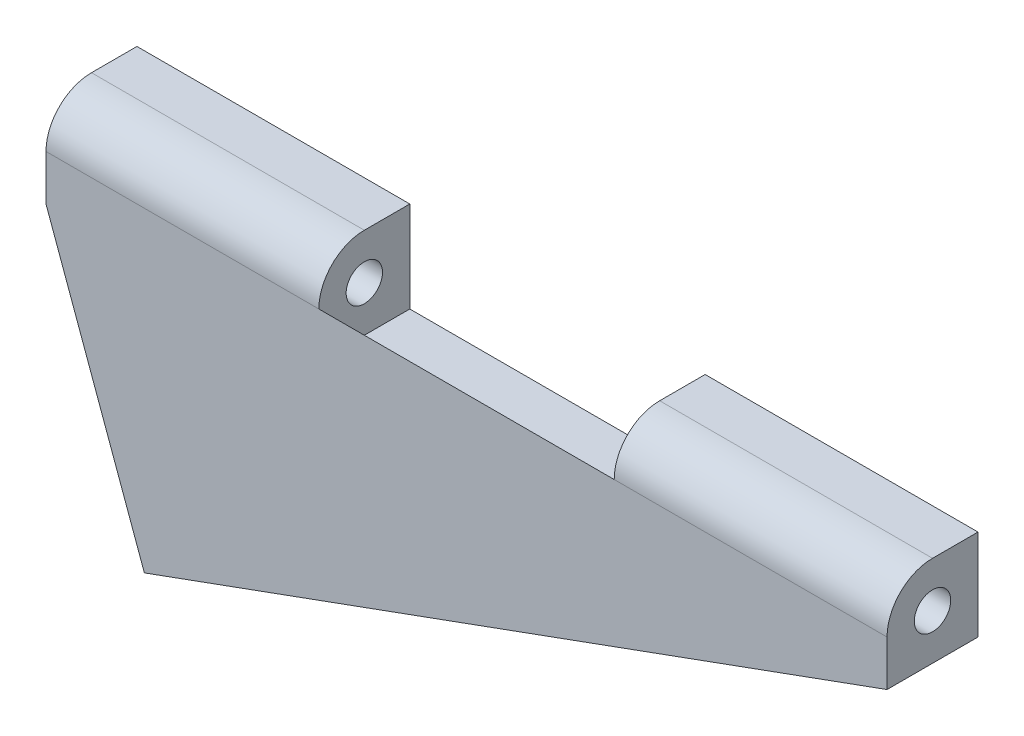
ISO-10303-21;
HEADER;
FILE_DESCRIPTION(('STEP AP214'),'2;1');
FILE_NAME('part.step','',(''),(''),'','','');
FILE_SCHEMA(('AUTOMOTIVE_DESIGN { 1 0 10303 214 1 1 1 1 }'));
ENDSEC;
DATA;
#1=APPLICATION_CONTEXT('core data for automotive mechanical design processes');
#2=APPLICATION_PROTOCOL_DEFINITION('international standard','automotive_design',2000,#1);
#3=PRODUCT_CONTEXT('',#1,'mechanical');
#4=PRODUCT('Part','Part','',(#3));
#5=PRODUCT_RELATED_PRODUCT_CATEGORY('part','',(#4));
#6=PRODUCT_DEFINITION_FORMATION('','',#4);
#7=PRODUCT_DEFINITION_CONTEXT('part definition',#1,'design');
#8=PRODUCT_DEFINITION('design','',#6,#7);
#9=PRODUCT_DEFINITION_SHAPE('','',#8);
#10=(LENGTH_UNIT() NAMED_UNIT(*) SI_UNIT(.MILLI.,.METRE.));
#11=(NAMED_UNIT(*) PLANE_ANGLE_UNIT() SI_UNIT($,.RADIAN.));
#12=(NAMED_UNIT(*) SI_UNIT($,.STERADIAN.) SOLID_ANGLE_UNIT());
#13=UNCERTAINTY_MEASURE_WITH_UNIT(LENGTH_MEASURE(1.E-05),#10,'distance_accuracy_value','');
#14=(GEOMETRIC_REPRESENTATION_CONTEXT(3) GLOBAL_UNCERTAINTY_ASSIGNED_CONTEXT((#13)) GLOBAL_UNIT_ASSIGNED_CONTEXT((#10,
#11,#12)) REPRESENTATION_CONTEXT('',''));
#15=CARTESIAN_POINT('',(0.,0.,0.));
#16=DIRECTION('',(0.,0.,1.));
#17=DIRECTION('',(1.,0.,0.));
#18=AXIS2_PLACEMENT_3D('',#15,#16,#17);
#19=CARTESIAN_POINT('',(0.,0.,0.));
#20=DIRECTION('',(0.,0.,1.));
#21=DIRECTION('',(1.,0.,0.));
#22=AXIS2_PLACEMENT_3D('',#19,#20,#21);
#23=PLANE('',#22);
#24=DIRECTION('',(0.,-1.,0.));
#25=VECTOR('',#24,1.);
#26=CARTESIAN_POINT('',(-39.6704168051158,0.,0.));
#27=LINE('',#26,#25);
#28=CARTESIAN_POINT('',(-39.6704168051158,6.35,0.));
#29=VERTEX_POINT('',#28);
#30=CARTESIAN_POINT('',(-39.6704168051158,0.,0.));
#31=VERTEX_POINT('',#30);
#32=EDGE_CURVE('E152',#29,#31,#27,.T.);
#33=ORIENTED_EDGE('',*,*,#32,.T.);
#34=DIRECTION('',(1.,0.,0.));
#35=VECTOR('',#34,1.);
#36=CARTESIAN_POINT('',(-67.700672926185,0.,0.));
#37=LINE('',#36,#35);
#38=CARTESIAN_POINT('',(-19.05,0.,0.));
#39=VERTEX_POINT('',#38);
#40=EDGE_CURVE('E207',#31,#39,#37,.T.);
#41=ORIENTED_EDGE('',*,*,#40,.T.);
#42=DIRECTION('',(0.,1.,0.));
#43=VECTOR('',#42,1.);
#44=CARTESIAN_POINT('',(-19.05,0.,0.));
#45=LINE('',#44,#43);
#46=CARTESIAN_POINT('',(-19.05,6.35,0.));
#47=VERTEX_POINT('',#46);
#48=EDGE_CURVE('E168',#39,#47,#45,.T.);
#49=ORIENTED_EDGE('',*,*,#48,.T.);
#50=DIRECTION('',(1.,0.,0.));
#51=VECTOR('',#50,1.);
#52=CARTESIAN_POINT('',(-58.7204168051158,6.35,0.));
#53=LINE('',#52,#51);
#54=CARTESIAN_POINT('',(0.,6.35,0.));
#55=VERTEX_POINT('',#54);
#56=EDGE_CURVE('E184',#47,#55,#53,.T.);
#57=ORIENTED_EDGE('',*,*,#56,.T.);
#58=DIRECTION('',(0.,1.,0.));
#59=VECTOR('',#58,1.);
#60=CARTESIAN_POINT('',(0.,0.,0.));
#61=LINE('',#60,#59);
#62=CARTESIAN_POINT('',(0.,0.,0.));
#63=VERTEX_POINT('',#62);
#64=EDGE_CURVE('E233',#63,#55,#61,.T.);
#65=ORIENTED_EDGE('',*,*,#64,.F.);
#66=DIRECTION('',(0.939692620785906,0.342020143325676,0.));
#67=VECTOR('',#66,1.);
#68=CARTESIAN_POINT('',(-51.8514328981523,-18.8723781789792,0.));
#69=LINE('',#68,#67);
#70=CARTESIAN_POINT('',(-51.8514328981523,-18.8723781789792,0.));
#71=VERTEX_POINT('',#70);
#72=EDGE_CURVE('E176',#71,#63,#69,.T.);
#73=ORIENTED_EDGE('',*,*,#72,.F.);
#74=DIRECTION('',(0.342020143325673,-0.939692620785907,0.));
#75=VECTOR('',#74,1.);
#76=CARTESIAN_POINT('',(-58.7204168051158,0.,0.));
#77=LINE('',#76,#75);
#78=CARTESIAN_POINT('',(-58.7204168051158,0.,0.));
#79=VERTEX_POINT('',#78);
#80=EDGE_CURVE('E173',#79,#71,#77,.T.);
#81=ORIENTED_EDGE('',*,*,#80,.F.);
#82=DIRECTION('',(0.,1.,0.));
#83=VECTOR('',#82,1.);
#84=CARTESIAN_POINT('',(-58.7204168051158,0.,0.));
#85=LINE('',#84,#83);
#86=CARTESIAN_POINT('',(-58.7204168051158,6.35,0.));
#87=VERTEX_POINT('',#86);
#88=EDGE_CURVE('E222',#79,#87,#85,.T.);
#89=ORIENTED_EDGE('',*,*,#88,.T.);
#90=EDGE_CURVE('E178',#87,#29,#53,.T.);
#91=ORIENTED_EDGE('',*,*,#90,.T.);
#92=EDGE_LOOP('',(#33,#41,#49,#57,#65,#73,#81,#89,#91));
#93=FACE_BOUND('',#92,.T.);
#94=ADVANCED_FACE('F51',(#93),#23,.F.);
#95=CARTESIAN_POINT('',(-58.7204168051158,3.175,3.175));
#96=DIRECTION('',(1.,0.,0.));
#97=DIRECTION('',(0.,0.,-1.));
#98=AXIS2_PLACEMENT_3D('',#95,#96,#97);
#99=CYLINDRICAL_SURFACE('',#98,3.175);
#100=DIRECTION('',(1.,0.,0.));
#101=VECTOR('',#100,1.);
#102=CARTESIAN_POINT('',(-58.7204168051158,3.175,6.35));
#103=LINE('',#102,#101);
#104=CARTESIAN_POINT('',(-58.7204168051158,3.175,6.35));
#105=VERTEX_POINT('',#104);
#106=CARTESIAN_POINT('',(-39.6704168051158,3.175,6.35));
#107=VERTEX_POINT('',#106);
#108=EDGE_CURVE('E166',#105,#107,#103,.T.);
#109=ORIENTED_EDGE('',*,*,#108,.T.);
#110=CARTESIAN_POINT('',(-39.6704168051158,3.175,3.175));
#111=DIRECTION('',(1.,0.,0.));
#112=DIRECTION('',(0.,0.,-1.));
#113=AXIS2_PLACEMENT_3D('',#110,#111,#112);
#114=CIRCLE('',#113,3.175);
#115=CARTESIAN_POINT('',(-39.6704168051158,6.35,3.175));
#116=VERTEX_POINT('',#115);
#117=EDGE_CURVE('E149',#107,#116,#114,.F.);
#118=ORIENTED_EDGE('',*,*,#117,.T.);
#119=DIRECTION('',(1.,0.,0.));
#120=VECTOR('',#119,1.);
#121=CARTESIAN_POINT('',(-58.7204168051158,6.35,3.175));
#122=LINE('',#121,#120);
#123=CARTESIAN_POINT('',(-58.7204168051158,6.35,3.175));
#124=VERTEX_POINT('',#123);
#125=EDGE_CURVE('E164',#124,#116,#122,.T.);
#126=ORIENTED_EDGE('',*,*,#125,.F.);
#127=CARTESIAN_POINT('',(-58.7204168051158,3.175,3.175));
#128=DIRECTION('',(1.,0.,0.));
#129=DIRECTION('',(0.,0.,-1.));
#130=AXIS2_PLACEMENT_3D('',#127,#128,#129);
#131=CIRCLE('',#130,3.175);
#132=EDGE_CURVE('E217',#124,#105,#131,.T.);
#133=ORIENTED_EDGE('',*,*,#132,.T.);
#134=EDGE_LOOP('',(#109,#118,#126,#133));
#135=FACE_BOUND('',#134,.T.);
#136=ADVANCED_FACE('F162',(#135),#99,.T.);
#137=CARTESIAN_POINT('',(-58.7204168051158,6.35,0.));
#138=DIRECTION('',(0.,-1.,0.));
#139=DIRECTION('',(0.,0.,-1.));
#140=AXIS2_PLACEMENT_3D('',#137,#138,#139);
#141=PLANE('',#140);
#142=DIRECTION('',(0.,0.,1.));
#143=VECTOR('',#142,1.);
#144=CARTESIAN_POINT('',(-39.6704168051158,6.35,0.));
#145=LINE('',#144,#143);
#146=EDGE_CURVE('E143',#29,#116,#145,.T.);
#147=ORIENTED_EDGE('',*,*,#146,.F.);
#148=ORIENTED_EDGE('',*,*,#90,.F.);
#149=DIRECTION('',(0.,0.,-1.));
#150=VECTOR('',#149,1.);
#151=CARTESIAN_POINT('',(-58.7204168051158,6.35,0.));
#152=LINE('',#151,#150);
#153=EDGE_CURVE('E171',#124,#87,#152,.T.);
#154=ORIENTED_EDGE('',*,*,#153,.F.);
#155=ORIENTED_EDGE('',*,*,#125,.T.);
#156=EDGE_LOOP('',(#147,#148,#154,#155));
#157=FACE_BOUND('',#156,.T.);
#158=ADVANCED_FACE('F170',(#157),#141,.F.);
#159=CARTESIAN_POINT('',(-58.7204168051158,3.175,3.175));
#160=DIRECTION('',(1.,0.,0.));
#161=DIRECTION('',(0.,0.,-1.));
#162=AXIS2_PLACEMENT_3D('',#159,#160,#161);
#163=CYLINDRICAL_SURFACE('',#162,1.27);
#164=CARTESIAN_POINT('',(-58.7204168051158,3.175,3.175));
#165=DIRECTION('',(1.,0.,0.));
#166=DIRECTION('',(0.,0.,-1.));
#167=AXIS2_PLACEMENT_3D('',#164,#165,#166);
#168=CIRCLE('',#167,1.27);
#169=CARTESIAN_POINT('',(-58.7204168051158,3.175,1.905));
#170=VERTEX_POINT('',#169);
#171=EDGE_CURVE('E214',#170,#170,#168,.T.);
#172=ORIENTED_EDGE('',*,*,#171,.F.);
#173=EDGE_LOOP('',(#172));
#174=FACE_BOUND('',#173,.T.);
#175=CARTESIAN_POINT('',(-39.6704168051158,3.175,3.175));
#176=DIRECTION('',(1.,0.,0.));
#177=DIRECTION('',(0.,0.,-1.));
#178=AXIS2_PLACEMENT_3D('',#175,#176,#177);
#179=CIRCLE('',#178,1.27);
#180=CARTESIAN_POINT('',(-39.6704168051158,3.175,1.905));
#181=VERTEX_POINT('',#180);
#182=EDGE_CURVE('E55',#181,#181,#179,.F.);
#183=ORIENTED_EDGE('',*,*,#182,.F.);
#184=EDGE_LOOP('',(#183));
#185=FACE_BOUND('',#184,.T.);
#186=ADVANCED_FACE('F288',(#174,#185),#163,.F.);
#187=CARTESIAN_POINT('',(-58.7204168051158,0.,6.35));
#188=DIRECTION('',(0.939692620785907,0.342020143325673,0.));
#189=DIRECTION('',(-0.342020143325673,0.939692620785907,0.));
#190=AXIS2_PLACEMENT_3D('',#187,#188,#189);
#191=PLANE('',#190);
#192=ORIENTED_EDGE('',*,*,#80,.T.);
#193=DIRECTION('',(0.,0.,-1.));
#194=VECTOR('',#193,1.);
#195=CARTESIAN_POINT('',(-51.8514328981523,-18.8723781789792,6.35));
#196=LINE('',#195,#194);
#197=CARTESIAN_POINT('',(-51.8514328981523,-18.8723781789792,6.35));
#198=VERTEX_POINT('',#197);
#199=EDGE_CURVE('E13',#198,#71,#196,.T.);
#200=ORIENTED_EDGE('',*,*,#199,.F.);
#201=DIRECTION('',(0.342020143325673,-0.939692620785907,0.));
#202=VECTOR('',#201,1.);
#203=CARTESIAN_POINT('',(-58.7204168051158,0.,6.35));
#204=LINE('',#203,#202);
#205=CARTESIAN_POINT('',(-58.7204168051158,0.,6.35));
#206=VERTEX_POINT('',#205);
#207=EDGE_CURVE('E77',#206,#198,#204,.T.);
#208=ORIENTED_EDGE('',*,*,#207,.F.);
#209=DIRECTION('',(0.,0.,-1.));
#210=VECTOR('',#209,1.);
#211=CARTESIAN_POINT('',(-58.7204168051158,0.,6.35));
#212=LINE('',#211,#210);
#213=EDGE_CURVE('E89',#206,#79,#212,.T.);
#214=ORIENTED_EDGE('',*,*,#213,.T.);
#215=EDGE_LOOP('',(#192,#200,#208,#214));
#216=FACE_BOUND('',#215,.T.);
#217=ADVANCED_FACE('F53',(#216),#191,.F.);
#218=CARTESIAN_POINT('',(-51.8514328981523,-18.8723781789792,6.35));
#219=DIRECTION('',(-0.342020143325676,0.939692620785906,0.));
#220=DIRECTION('',(-0.939692620785906,-0.342020143325676,0.));
#221=AXIS2_PLACEMENT_3D('',#218,#219,#220);
#222=PLANE('',#221);
#223=ORIENTED_EDGE('',*,*,#72,.T.);
#224=DIRECTION('',(0.,0.,-1.));
#225=VECTOR('',#224,1.);
#226=CARTESIAN_POINT('',(0.,0.,6.35));
#227=LINE('',#226,#225);
#228=CARTESIAN_POINT('',(0.,0.,6.35));
#229=VERTEX_POINT('',#228);
#230=EDGE_CURVE('E60',#229,#63,#227,.T.);
#231=ORIENTED_EDGE('',*,*,#230,.F.);
#232=DIRECTION('',(0.939692620785906,0.342020143325676,0.));
#233=VECTOR('',#232,1.);
#234=CARTESIAN_POINT('',(-51.8514328981523,-18.8723781789792,6.35));
#235=LINE('',#234,#233);
#236=EDGE_CURVE('E94',#198,#229,#235,.T.);
#237=ORIENTED_EDGE('',*,*,#236,.F.);
#238=ORIENTED_EDGE('',*,*,#199,.T.);
#239=EDGE_LOOP('',(#223,#231,#237,#238));
#240=FACE_BOUND('',#239,.T.);
#241=ADVANCED_FACE('F252',(#240),#222,.F.);
#242=CARTESIAN_POINT('',(0.,0.,6.35));
#243=DIRECTION('',(0.,0.,1.));
#244=DIRECTION('',(1.,0.,0.));
#245=AXIS2_PLACEMENT_3D('',#242,#243,#244);
#246=PLANE('',#245);
#247=ORIENTED_EDGE('',*,*,#207,.T.);
#248=ORIENTED_EDGE('',*,*,#236,.T.);
#249=DIRECTION('',(0.,-1.,0.));
#250=VECTOR('',#249,1.);
#251=CARTESIAN_POINT('',(0.,0.,6.35));
#252=LINE('',#251,#250);
#253=CARTESIAN_POINT('',(0.,3.175,6.35));
#254=VERTEX_POINT('',#253);
#255=EDGE_CURVE('E231',#254,#229,#252,.T.);
#256=ORIENTED_EDGE('',*,*,#255,.F.);
#257=CARTESIAN_POINT('',(-19.05,3.175,6.35));
#258=VERTEX_POINT('',#257);
#259=EDGE_CURVE('E186',#258,#254,#103,.T.);
#260=ORIENTED_EDGE('',*,*,#259,.F.);
#261=DIRECTION('',(1.,0.,0.));
#262=VECTOR('',#261,1.);
#263=CARTESIAN_POINT('',(-67.700672926185,3.175,6.35));
#264=LINE('',#263,#262);
#265=EDGE_CURVE('E198',#107,#258,#264,.T.);
#266=ORIENTED_EDGE('',*,*,#265,.F.);
#267=ORIENTED_EDGE('',*,*,#108,.F.);
#268=DIRECTION('',(0.,-1.,0.));
#269=VECTOR('',#268,1.);
#270=CARTESIAN_POINT('',(-58.7204168051158,0.,6.35));
#271=LINE('',#270,#269);
#272=EDGE_CURVE('E219',#105,#206,#271,.T.);
#273=ORIENTED_EDGE('',*,*,#272,.T.);
#274=EDGE_LOOP('',(#247,#248,#256,#260,#266,#267,#273));
#275=FACE_BOUND('',#274,.T.);
#276=ADVANCED_FACE('F251',(#275),#246,.T.);
#277=CARTESIAN_POINT('',(-19.05,3.175,3.175));
#278=DIRECTION('',(1.,0.,0.));
#279=DIRECTION('',(0.,0.,-1.));
#280=AXIS2_PLACEMENT_3D('',#277,#278,#279);
#281=CIRCLE('',#280,3.175);
#282=CARTESIAN_POINT('',(-19.05,6.35,3.175));
#283=VERTEX_POINT('',#282);
#284=EDGE_CURVE('E68',#283,#258,#281,.T.);
#285=ORIENTED_EDGE('',*,*,#284,.T.);
#286=ORIENTED_EDGE('',*,*,#259,.T.);
#287=CARTESIAN_POINT('',(0.,3.175,3.175));
#288=DIRECTION('',(1.,0.,0.));
#289=DIRECTION('',(0.,0.,-1.));
#290=AXIS2_PLACEMENT_3D('',#287,#288,#289);
#291=CIRCLE('',#290,3.175);
#292=CARTESIAN_POINT('',(0.,6.35,3.175));
#293=VERTEX_POINT('',#292);
#294=EDGE_CURVE('E228',#293,#254,#291,.T.);
#295=ORIENTED_EDGE('',*,*,#294,.F.);
#296=EDGE_CURVE('E174',#283,#293,#122,.T.);
#297=ORIENTED_EDGE('',*,*,#296,.F.);
#298=EDGE_LOOP('',(#285,#286,#295,#297));
#299=FACE_BOUND('',#298,.T.);
#300=ADVANCED_FACE('F246',(#299),#99,.T.);
#301=ORIENTED_EDGE('',*,*,#56,.F.);
#302=DIRECTION('',(0.,0.,-1.));
#303=VECTOR('',#302,1.);
#304=CARTESIAN_POINT('',(-19.05,6.35,0.));
#305=LINE('',#304,#303);
#306=EDGE_CURVE('E157',#283,#47,#305,.T.);
#307=ORIENTED_EDGE('',*,*,#306,.F.);
#308=ORIENTED_EDGE('',*,*,#296,.T.);
#309=DIRECTION('',(0.,0.,-1.));
#310=VECTOR('',#309,1.);
#311=CARTESIAN_POINT('',(0.,6.35,0.));
#312=LINE('',#311,#310);
#313=EDGE_CURVE('E181',#293,#55,#312,.T.);
#314=ORIENTED_EDGE('',*,*,#313,.T.);
#315=EDGE_LOOP('',(#301,#307,#308,#314));
#316=FACE_BOUND('',#315,.T.);
#317=ADVANCED_FACE('F241',(#316),#141,.F.);
#318=CARTESIAN_POINT('',(-19.05,3.175,3.175));
#319=DIRECTION('',(1.,0.,0.));
#320=DIRECTION('',(0.,0.,-1.));
#321=AXIS2_PLACEMENT_3D('',#318,#319,#320);
#322=CIRCLE('',#321,1.27);
#323=CARTESIAN_POINT('',(-19.05,3.175,1.905));
#324=VERTEX_POINT('',#323);
#325=EDGE_CURVE('E192',#324,#324,#322,.F.);
#326=ORIENTED_EDGE('',*,*,#325,.T.);
#327=EDGE_LOOP('',(#326));
#328=FACE_BOUND('',#327,.T.);
#329=CARTESIAN_POINT('',(0.,3.175,3.175));
#330=DIRECTION('',(1.,0.,0.));
#331=DIRECTION('',(0.,0.,-1.));
#332=AXIS2_PLACEMENT_3D('',#329,#330,#331);
#333=CIRCLE('',#332,1.27);
#334=CARTESIAN_POINT('',(0.,3.175,1.905));
#335=VERTEX_POINT('',#334);
#336=EDGE_CURVE('E213',#335,#335,#333,.T.);
#337=ORIENTED_EDGE('',*,*,#336,.T.);
#338=EDGE_LOOP('',(#337));
#339=FACE_BOUND('',#338,.T.);
#340=ADVANCED_FACE('F293',(#328,#339),#163,.F.);
#341=CARTESIAN_POINT('',(-58.7204168051158,0.,0.));
#342=DIRECTION('',(1.,0.,0.));
#343=DIRECTION('',(0.,0.,-1.));
#344=AXIS2_PLACEMENT_3D('',#341,#342,#343);
#345=PLANE('',#344);
#346=ORIENTED_EDGE('',*,*,#171,.T.);
#347=EDGE_LOOP('',(#346));
#348=FACE_BOUND('',#347,.T.);
#349=ORIENTED_EDGE('',*,*,#132,.F.);
#350=ORIENTED_EDGE('',*,*,#153,.T.);
#351=ORIENTED_EDGE('',*,*,#88,.F.);
#352=ORIENTED_EDGE('',*,*,#213,.F.);
#353=ORIENTED_EDGE('',*,*,#272,.F.);
#354=EDGE_LOOP('',(#349,#350,#351,#352,#353));
#355=FACE_BOUND('',#354,.T.);
#356=ADVANCED_FACE('F296',(#348,#355),#345,.F.);
#357=CARTESIAN_POINT('',(0.,0.,0.));
#358=DIRECTION('',(1.,0.,0.));
#359=DIRECTION('',(0.,0.,-1.));
#360=AXIS2_PLACEMENT_3D('',#357,#358,#359);
#361=PLANE('',#360);
#362=ORIENTED_EDGE('',*,*,#336,.F.);
#363=EDGE_LOOP('',(#362));
#364=FACE_BOUND('',#363,.T.);
#365=ORIENTED_EDGE('',*,*,#294,.T.);
#366=ORIENTED_EDGE('',*,*,#255,.T.);
#367=ORIENTED_EDGE('',*,*,#230,.T.);
#368=ORIENTED_EDGE('',*,*,#64,.T.);
#369=ORIENTED_EDGE('',*,*,#313,.F.);
#370=EDGE_LOOP('',(#365,#366,#367,#368,#369));
#371=FACE_BOUND('',#370,.T.);
#372=ADVANCED_FACE('F244',(#364,#371),#361,.T.);
#373=CARTESIAN_POINT('',(-39.6704168051158,0.,0.));
#374=DIRECTION('',(1.,0.,0.));
#375=DIRECTION('',(0.,0.,-1.));
#376=AXIS2_PLACEMENT_3D('',#373,#374,#375);
#377=PLANE('',#376);
#378=DIRECTION('',(0.,0.,1.));
#379=VECTOR('',#378,1.);
#380=CARTESIAN_POINT('',(-39.6704168051158,0.,0.));
#381=LINE('',#380,#379);
#382=CARTESIAN_POINT('',(-39.6704168051158,0.,3.175));
#383=VERTEX_POINT('',#382);
#384=EDGE_CURVE('E194',#31,#383,#381,.T.);
#385=ORIENTED_EDGE('',*,*,#384,.F.);
#386=ORIENTED_EDGE('',*,*,#32,.F.);
#387=ORIENTED_EDGE('',*,*,#146,.T.);
#388=ORIENTED_EDGE('',*,*,#117,.F.);
#389=EDGE_CURVE('E167',#383,#107,#114,.F.);
#390=ORIENTED_EDGE('',*,*,#389,.F.);
#391=EDGE_LOOP('',(#385,#386,#387,#388,#390));
#392=FACE_BOUND('',#391,.T.);
#393=ORIENTED_EDGE('',*,*,#182,.T.);
#394=EDGE_LOOP('',(#393));
#395=FACE_BOUND('',#394,.T.);
#396=ADVANCED_FACE('F146',(#392,#395),#377,.T.);
#397=CARTESIAN_POINT('',(-19.05,0.,0.));
#398=DIRECTION('',(1.,0.,0.));
#399=DIRECTION('',(0.,0.,-1.));
#400=AXIS2_PLACEMENT_3D('',#397,#398,#399);
#401=PLANE('',#400);
#402=ORIENTED_EDGE('',*,*,#48,.F.);
#403=DIRECTION('',(0.,0.,-1.));
#404=VECTOR('',#403,1.);
#405=CARTESIAN_POINT('',(-19.05,0.,0.));
#406=LINE('',#405,#404);
#407=CARTESIAN_POINT('',(-19.05,0.,3.175));
#408=VERTEX_POINT('',#407);
#409=EDGE_CURVE('E257',#408,#39,#406,.T.);
#410=ORIENTED_EDGE('',*,*,#409,.F.);
#411=EDGE_CURVE('E210',#258,#408,#281,.T.);
#412=ORIENTED_EDGE('',*,*,#411,.F.);
#413=ORIENTED_EDGE('',*,*,#284,.F.);
#414=ORIENTED_EDGE('',*,*,#306,.T.);
#415=EDGE_LOOP('',(#402,#410,#412,#413,#414));
#416=FACE_BOUND('',#415,.T.);
#417=ORIENTED_EDGE('',*,*,#325,.F.);
#418=EDGE_LOOP('',(#417));
#419=FACE_BOUND('',#418,.T.);
#420=ADVANCED_FACE('F260',(#416,#419),#401,.F.);
#421=CARTESIAN_POINT('',(-67.700672926185,3.175,3.175));
#422=DIRECTION('',(1.,0.,0.));
#423=DIRECTION('',(0.,0.,-1.));
#424=AXIS2_PLACEMENT_3D('',#421,#422,#423);
#425=CYLINDRICAL_SURFACE('',#424,3.175);
#426=ORIENTED_EDGE('',*,*,#265,.T.);
#427=ORIENTED_EDGE('',*,*,#411,.T.);
#428=DIRECTION('',(1.,0.,0.));
#429=VECTOR('',#428,1.);
#430=CARTESIAN_POINT('',(-67.700672926185,0.,3.175));
#431=LINE('',#430,#429);
#432=EDGE_CURVE('E158',#383,#408,#431,.T.);
#433=ORIENTED_EDGE('',*,*,#432,.F.);
#434=ORIENTED_EDGE('',*,*,#389,.T.);
#435=EDGE_LOOP('',(#426,#427,#433,#434));
#436=FACE_BOUND('',#435,.T.);
#437=ADVANCED_FACE('F263',(#436),#425,.F.);
#438=CARTESIAN_POINT('',(-67.700672926185,0.,0.));
#439=DIRECTION('',(0.,-1.,0.));
#440=DIRECTION('',(0.,0.,-1.));
#441=AXIS2_PLACEMENT_3D('',#438,#439,#440);
#442=PLANE('',#441);
#443=ORIENTED_EDGE('',*,*,#384,.T.);
#444=ORIENTED_EDGE('',*,*,#432,.T.);
#445=ORIENTED_EDGE('',*,*,#409,.T.);
#446=ORIENTED_EDGE('',*,*,#40,.F.);
#447=EDGE_LOOP('',(#443,#444,#445,#446));
#448=FACE_BOUND('',#447,.T.);
#449=ADVANCED_FACE('F265',(#448),#442,.F.);
#450=CLOSED_SHELL('',(#94,#136,#158,#186,#217,#241,#276,#300,#317,#340,#356,#372,#396,#420,#437,#449));
#451=MANIFOLD_SOLID_BREP('B2',#450);
#452=ADVANCED_BREP_SHAPE_REPRESENTATION('',(#18,#451),#14);
#453=SHAPE_DEFINITION_REPRESENTATION(#9,#452);
ENDSEC;
END-ISO-10303-21;
